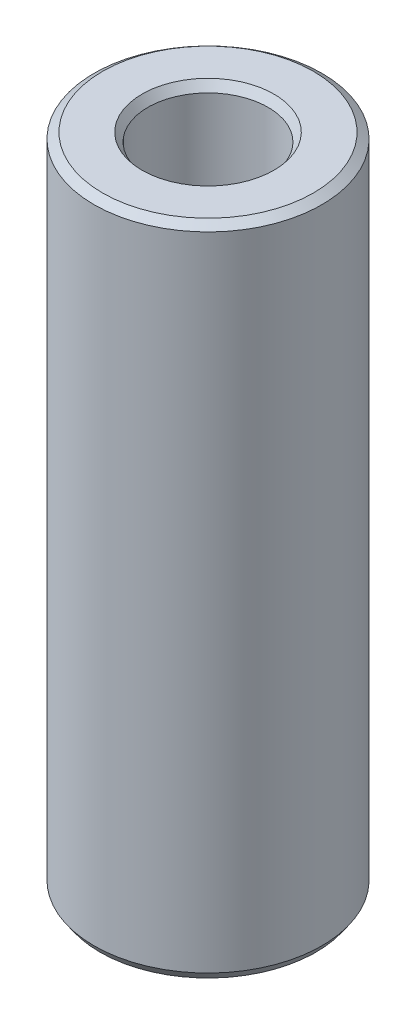
ISO-10303-21;
HEADER;
FILE_DESCRIPTION(('STEP AP214'),'2;1');
FILE_NAME('part.step','',(''),(''),'','','');
FILE_SCHEMA(('AUTOMOTIVE_DESIGN { 1 0 10303 214 1 1 1 1 }'));
ENDSEC;
DATA;
#1=APPLICATION_CONTEXT('core data for automotive mechanical design processes');
#2=APPLICATION_PROTOCOL_DEFINITION('international standard','automotive_design',2000,#1);
#3=PRODUCT_CONTEXT('',#1,'mechanical');
#4=PRODUCT('Part','Part','',(#3));
#5=PRODUCT_RELATED_PRODUCT_CATEGORY('part','',(#4));
#6=PRODUCT_DEFINITION_FORMATION('','',#4);
#7=PRODUCT_DEFINITION_CONTEXT('part definition',#1,'design');
#8=PRODUCT_DEFINITION('design','',#6,#7);
#9=PRODUCT_DEFINITION_SHAPE('','',#8);
#10=(LENGTH_UNIT() NAMED_UNIT(*) SI_UNIT(.MILLI.,.METRE.));
#11=(NAMED_UNIT(*) PLANE_ANGLE_UNIT() SI_UNIT($,.RADIAN.));
#12=(NAMED_UNIT(*) SI_UNIT($,.STERADIAN.) SOLID_ANGLE_UNIT());
#13=UNCERTAINTY_MEASURE_WITH_UNIT(LENGTH_MEASURE(1.E-05),#10,'distance_accuracy_value','');
#14=(GEOMETRIC_REPRESENTATION_CONTEXT(3) GLOBAL_UNCERTAINTY_ASSIGNED_CONTEXT((#13)) GLOBAL_UNIT_ASSIGNED_CONTEXT((#10,
#11,#12)) REPRESENTATION_CONTEXT('',''));
#15=CARTESIAN_POINT('',(0.,0.,0.));
#16=DIRECTION('',(0.,0.,1.));
#17=DIRECTION('',(1.,0.,0.));
#18=AXIS2_PLACEMENT_3D('',#15,#16,#17);
#19=CARTESIAN_POINT('',(0.,230.466114612719,0.));
#20=DIRECTION('',(0.,-1.,0.));
#21=DIRECTION('',(0.,0.,-1.));
#22=AXIS2_PLACEMENT_3D('',#19,#20,#21);
#23=CYLINDRICAL_SURFACE('',#22,40.);
#24=CARTESIAN_POINT('',(0.,2.98049751840712,0.));
#25=DIRECTION('',(0.,1.,0.));
#26=DIRECTION('',(0.,0.,1.));
#27=AXIS2_PLACEMENT_3D('',#24,#25,#26);
#28=CIRCLE('',#27,40.);
#29=CARTESIAN_POINT('',(0.,2.98049751840712,40.));
#30=VERTEX_POINT('',#29);
#31=EDGE_CURVE('E10',#30,#30,#28,.T.);
#32=ORIENTED_EDGE('',*,*,#31,.T.);
#33=EDGE_LOOP('',(#32));
#34=FACE_BOUND('',#33,.T.);
#35=CARTESIAN_POINT('',(0.,228.395326379889,0.));
#36=DIRECTION('',(0.,1.,0.));
#37=DIRECTION('',(0.,0.,1.));
#38=AXIS2_PLACEMENT_3D('',#35,#36,#37);
#39=CIRCLE('',#38,40.);
#40=CARTESIAN_POINT('',(0.,228.395326379889,40.));
#41=VERTEX_POINT('',#40);
#42=EDGE_CURVE('E50',#41,#41,#39,.F.);
#43=ORIENTED_EDGE('',*,*,#42,.T.);
#44=EDGE_LOOP('',(#43));
#45=FACE_BOUND('',#44,.T.);
#46=ADVANCED_FACE('F39',(#34,#45),#23,.T.);
#47=CARTESIAN_POINT('',(0.,230.466114612719,0.));
#48=DIRECTION('',(0.,1.,0.));
#49=DIRECTION('',(0.,0.,1.));
#50=AXIS2_PLACEMENT_3D('',#47,#48,#49);
#51=PLANE('',#50);
#52=CARTESIAN_POINT('',(0.,230.466114612719,0.));
#53=DIRECTION('',(0.,1.,0.));
#54=DIRECTION('',(0.,0.,1.));
#55=AXIS2_PLACEMENT_3D('',#52,#53,#54);
#56=CIRCLE('',#55,23.1754468165007);
#57=CARTESIAN_POINT('',(0.,230.466114612719,23.1754468165007));
#58=VERTEX_POINT('',#57);
#59=EDGE_CURVE('E58',#58,#58,#56,.F.);
#60=ORIENTED_EDGE('',*,*,#59,.T.);
#61=EDGE_LOOP('',(#60));
#62=FACE_BOUND('',#61,.T.);
#63=CARTESIAN_POINT('',(0.,230.466114612719,0.));
#64=DIRECTION('',(0.,1.,0.));
#65=DIRECTION('',(0.,0.,1.));
#66=AXIS2_PLACEMENT_3D('',#63,#64,#65);
#67=CIRCLE('',#66,37.0195024815929);
#68=CARTESIAN_POINT('',(0.,230.466114612719,37.0195024815929));
#69=VERTEX_POINT('',#68);
#70=EDGE_CURVE('E61',#69,#69,#67,.T.);
#71=ORIENTED_EDGE('',*,*,#70,.T.);
#72=EDGE_LOOP('',(#71));
#73=FACE_BOUND('',#72,.T.);
#74=ADVANCED_FACE('F88',(#62,#73),#51,.T.);
#75=CARTESIAN_POINT('',(0.,0.,0.));
#76=DIRECTION('',(0.,1.,0.));
#77=DIRECTION('',(0.,0.,1.));
#78=AXIS2_PLACEMENT_3D('',#75,#76,#77);
#79=PLANE('',#78);
#80=CARTESIAN_POINT('',(0.,0.,0.));
#81=DIRECTION('',(0.,1.,0.));
#82=DIRECTION('',(0.,0.,1.));
#83=AXIS2_PLACEMENT_3D('',#80,#81,#82);
#84=CIRCLE('',#83,24.0851561020776);
#85=CARTESIAN_POINT('',(0.,0.,24.0851561020776));
#86=VERTEX_POINT('',#85);
#87=EDGE_CURVE('E51',#86,#86,#84,.T.);
#88=ORIENTED_EDGE('',*,*,#87,.T.);
#89=EDGE_LOOP('',(#88));
#90=FACE_BOUND('',#89,.T.);
#91=CARTESIAN_POINT('',(0.,0.,0.));
#92=DIRECTION('',(0.,1.,0.));
#93=DIRECTION('',(0.,0.,1.));
#94=AXIS2_PLACEMENT_3D('',#91,#92,#93);
#95=CIRCLE('',#94,37.9292117671698);
#96=CARTESIAN_POINT('',(0.,0.,37.9292117671698));
#97=VERTEX_POINT('',#96);
#98=EDGE_CURVE('E54',#97,#97,#95,.F.);
#99=ORIENTED_EDGE('',*,*,#98,.T.);
#100=EDGE_LOOP('',(#99));
#101=FACE_BOUND('',#100,.T.);
#102=ADVANCED_FACE('F83',(#90,#101),#79,.F.);
#103=CARTESIAN_POINT('',(0.,230.466114612719,0.));
#104=DIRECTION('',(0.,-1.,0.));
#105=DIRECTION('',(0.,0.,-1.));
#106=AXIS2_PLACEMENT_3D('',#103,#104,#105);
#107=CYLINDRICAL_SURFACE('',#106,21.1046585836706);
#108=CARTESIAN_POINT('',(0.,227.485617094312,0.));
#109=DIRECTION('',(0.,1.,0.));
#110=DIRECTION('',(0.,0.,1.));
#111=AXIS2_PLACEMENT_3D('',#108,#109,#110);
#112=CIRCLE('',#111,21.1046585836706);
#113=CARTESIAN_POINT('',(0.,227.485617094312,21.1046585836706));
#114=VERTEX_POINT('',#113);
#115=EDGE_CURVE('E67',#114,#114,#112,.T.);
#116=ORIENTED_EDGE('',*,*,#115,.T.);
#117=EDGE_LOOP('',(#116));
#118=FACE_BOUND('',#117,.T.);
#119=CARTESIAN_POINT('',(0.,2.07078823283011,0.));
#120=DIRECTION('',(0.,1.,0.));
#121=DIRECTION('',(0.,0.,1.));
#122=AXIS2_PLACEMENT_3D('',#119,#120,#121);
#123=CIRCLE('',#122,21.1046585836706);
#124=CARTESIAN_POINT('',(0.,2.07078823283011,21.1046585836706));
#125=VERTEX_POINT('',#124);
#126=EDGE_CURVE('E69',#125,#125,#123,.F.);
#127=ORIENTED_EDGE('',*,*,#126,.T.);
#128=EDGE_LOOP('',(#127));
#129=FACE_BOUND('',#128,.T.);
#130=ADVANCED_FACE('F71',(#118,#129),#107,.F.);
#131=CARTESIAN_POINT('',(0.,227.485617094312,0.));
#132=DIRECTION('',(0.,1.,0.));
#133=DIRECTION('',(0.,0.,1.));
#134=AXIS2_PLACEMENT_3D('',#131,#132,#133);
#135=CONICAL_SURFACE('',#134,21.1046585836706,0.607213595772118);
#136=ORIENTED_EDGE('',*,*,#59,.F.);
#137=EDGE_LOOP('',(#136));
#138=FACE_BOUND('',#137,.T.);
#139=ORIENTED_EDGE('',*,*,#115,.F.);
#140=EDGE_LOOP('',(#139));
#141=FACE_BOUND('',#140,.T.);
#142=ADVANCED_FACE('F77',(#138,#141),#135,.F.);
#143=CARTESIAN_POINT('',(0.,0.,0.));
#144=DIRECTION('',(0.,-1.,0.));
#145=DIRECTION('',(0.,0.,-1.));
#146=AXIS2_PLACEMENT_3D('',#143,#144,#145);
#147=CONICAL_SURFACE('',#146,24.0851561020776,0.963582731022784);
#148=ORIENTED_EDGE('',*,*,#126,.F.);
#149=EDGE_LOOP('',(#148));
#150=FACE_BOUND('',#149,.T.);
#151=ORIENTED_EDGE('',*,*,#87,.F.);
#152=EDGE_LOOP('',(#151));
#153=FACE_BOUND('',#152,.T.);
#154=ADVANCED_FACE('F73',(#150,#153),#147,.F.);
#155=CARTESIAN_POINT('',(0.,2.98049751840712,0.));
#156=DIRECTION('',(0.,1.,0.));
#157=DIRECTION('',(0.,0.,1.));
#158=AXIS2_PLACEMENT_3D('',#155,#156,#157);
#159=CONICAL_SURFACE('',#158,40.,0.607213595772114);
#160=ORIENTED_EDGE('',*,*,#98,.F.);
#161=EDGE_LOOP('',(#160));
#162=FACE_BOUND('',#161,.T.);
#163=ORIENTED_EDGE('',*,*,#31,.F.);
#164=EDGE_LOOP('',(#163));
#165=FACE_BOUND('',#164,.T.);
#166=ADVANCED_FACE('F76',(#162,#165),#159,.T.);
#167=CARTESIAN_POINT('',(0.,230.466114612719,0.));
#168=DIRECTION('',(0.,-1.,0.));
#169=DIRECTION('',(0.,0.,-1.));
#170=AXIS2_PLACEMENT_3D('',#167,#168,#169);
#171=CONICAL_SURFACE('',#170,37.0195024815929,0.963582731022791);
#172=ORIENTED_EDGE('',*,*,#42,.F.);
#173=EDGE_LOOP('',(#172));
#174=FACE_BOUND('',#173,.T.);
#175=ORIENTED_EDGE('',*,*,#70,.F.);
#176=EDGE_LOOP('',(#175));
#177=FACE_BOUND('',#176,.T.);
#178=ADVANCED_FACE('F45',(#174,#177),#171,.T.);
#179=CLOSED_SHELL('',(#46,#74,#102,#130,#142,#154,#166,#178));
#180=MANIFOLD_SOLID_BREP('B2',#179);
#181=ADVANCED_BREP_SHAPE_REPRESENTATION('',(#18,#180),#14);
#182=SHAPE_DEFINITION_REPRESENTATION(#9,#181);
ENDSEC;
END-ISO-10303-21;
